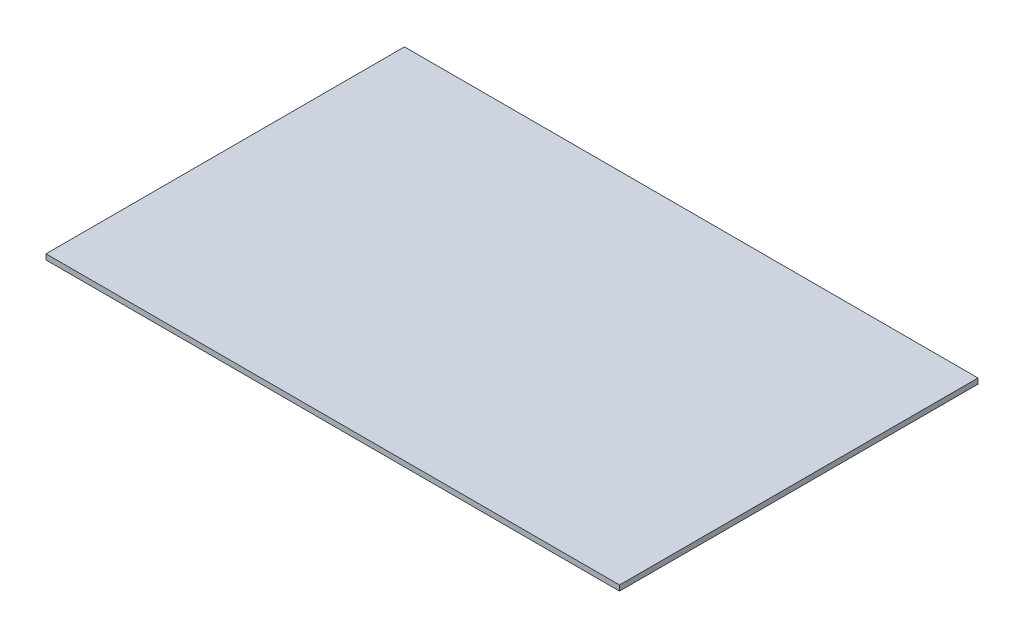
ISO-10303-21;
HEADER;
FILE_DESCRIPTION(('STEP AP214'),'2;1');
FILE_NAME('part.step','',(''),(''),'','','');
FILE_SCHEMA(('AUTOMOTIVE_DESIGN { 1 0 10303 214 1 1 1 1 }'));
ENDSEC;
DATA;
#1=APPLICATION_CONTEXT('core data for automotive mechanical design processes');
#2=APPLICATION_PROTOCOL_DEFINITION('international standard','automotive_design',2000,#1);
#3=PRODUCT_CONTEXT('',#1,'mechanical');
#4=PRODUCT('Part','Part','',(#3));
#5=PRODUCT_RELATED_PRODUCT_CATEGORY('part','',(#4));
#6=PRODUCT_DEFINITION_FORMATION('','',#4);
#7=PRODUCT_DEFINITION_CONTEXT('part definition',#1,'design');
#8=PRODUCT_DEFINITION('design','',#6,#7);
#9=PRODUCT_DEFINITION_SHAPE('','',#8);
#10=(LENGTH_UNIT() NAMED_UNIT(*) SI_UNIT(.MILLI.,.METRE.));
#11=(NAMED_UNIT(*) PLANE_ANGLE_UNIT() SI_UNIT($,.RADIAN.));
#12=(NAMED_UNIT(*) SI_UNIT($,.STERADIAN.) SOLID_ANGLE_UNIT());
#13=UNCERTAINTY_MEASURE_WITH_UNIT(LENGTH_MEASURE(1.E-05),#10,'distance_accuracy_value','');
#14=(GEOMETRIC_REPRESENTATION_CONTEXT(3) GLOBAL_UNCERTAINTY_ASSIGNED_CONTEXT((#13)) GLOBAL_UNIT_ASSIGNED_CONTEXT((#10,
#11,#12)) REPRESENTATION_CONTEXT('',''));
#15=CARTESIAN_POINT('',(0.,0.,0.));
#16=DIRECTION('',(0.,0.,1.));
#17=DIRECTION('',(1.,0.,0.));
#18=AXIS2_PLACEMENT_3D('',#15,#16,#17);
#19=CARTESIAN_POINT('',(80.,1.5,-50.));
#20=DIRECTION('',(-1.,0.,0.));
#21=DIRECTION('',(0.,0.,1.));
#22=AXIS2_PLACEMENT_3D('',#19,#20,#21);
#23=PLANE('',#22);
#24=DIRECTION('',(0.,0.,-1.));
#25=VECTOR('',#24,1.);
#26=CARTESIAN_POINT('',(80.,0.,-50.));
#27=LINE('',#26,#25);
#28=CARTESIAN_POINT('',(80.,0.,50.));
#29=VERTEX_POINT('',#28);
#30=CARTESIAN_POINT('',(80.,0.,-50.));
#31=VERTEX_POINT('',#30);
#32=EDGE_CURVE('E98',#29,#31,#27,.T.);
#33=ORIENTED_EDGE('',*,*,#32,.T.);
#34=DIRECTION('',(0.,-1.,0.));
#35=VECTOR('',#34,1.);
#36=CARTESIAN_POINT('',(80.,1.5,-50.));
#37=LINE('',#36,#35);
#38=CARTESIAN_POINT('',(80.,1.5,-50.));
#39=VERTEX_POINT('',#38);
#40=EDGE_CURVE('E11',#39,#31,#37,.T.);
#41=ORIENTED_EDGE('',*,*,#40,.F.);
#42=DIRECTION('',(0.,0.,-1.));
#43=VECTOR('',#42,1.);
#44=CARTESIAN_POINT('',(80.,1.5,-50.));
#45=LINE('',#44,#43);
#46=CARTESIAN_POINT('',(80.,1.5,50.));
#47=VERTEX_POINT('',#46);
#48=EDGE_CURVE('E86',#47,#39,#45,.T.);
#49=ORIENTED_EDGE('',*,*,#48,.F.);
#50=DIRECTION('',(0.,-1.,0.));
#51=VECTOR('',#50,1.);
#52=CARTESIAN_POINT('',(80.,1.5,50.));
#53=LINE('',#52,#51);
#54=EDGE_CURVE('E94',#47,#29,#53,.T.);
#55=ORIENTED_EDGE('',*,*,#54,.T.);
#56=EDGE_LOOP('',(#33,#41,#49,#55));
#57=FACE_BOUND('',#56,.T.);
#58=ADVANCED_FACE('F35',(#57),#23,.F.);
#59=CARTESIAN_POINT('',(-80.,1.5,-50.));
#60=DIRECTION('',(0.,0.,1.));
#61=DIRECTION('',(1.,0.,0.));
#62=AXIS2_PLACEMENT_3D('',#59,#60,#61);
#63=PLANE('',#62);
#64=DIRECTION('',(-1.,0.,0.));
#65=VECTOR('',#64,1.);
#66=CARTESIAN_POINT('',(-80.,0.,-50.));
#67=LINE('',#66,#65);
#68=CARTESIAN_POINT('',(-80.,0.,-50.));
#69=VERTEX_POINT('',#68);
#70=EDGE_CURVE('E90',#31,#69,#67,.T.);
#71=ORIENTED_EDGE('',*,*,#70,.T.);
#72=DIRECTION('',(0.,-1.,0.));
#73=VECTOR('',#72,1.);
#74=CARTESIAN_POINT('',(-80.,1.5,-50.));
#75=LINE('',#74,#73);
#76=CARTESIAN_POINT('',(-80.,1.5,-50.));
#77=VERTEX_POINT('',#76);
#78=EDGE_CURVE('E43',#77,#69,#75,.T.);
#79=ORIENTED_EDGE('',*,*,#78,.F.);
#80=DIRECTION('',(-1.,0.,0.));
#81=VECTOR('',#80,1.);
#82=CARTESIAN_POINT('',(-80.,1.5,-50.));
#83=LINE('',#82,#81);
#84=EDGE_CURVE('E81',#39,#77,#83,.T.);
#85=ORIENTED_EDGE('',*,*,#84,.F.);
#86=ORIENTED_EDGE('',*,*,#40,.T.);
#87=EDGE_LOOP('',(#71,#79,#85,#86));
#88=FACE_BOUND('',#87,.T.);
#89=ADVANCED_FACE('F89',(#88),#63,.F.);
#90=CARTESIAN_POINT('',(-80.,1.5,-50.));
#91=DIRECTION('',(1.,0.,0.));
#92=DIRECTION('',(0.,0.,-1.));
#93=AXIS2_PLACEMENT_3D('',#90,#91,#92);
#94=PLANE('',#93);
#95=DIRECTION('',(0.,0.,1.));
#96=VECTOR('',#95,1.);
#97=CARTESIAN_POINT('',(-80.,0.,-50.));
#98=LINE('',#97,#96);
#99=CARTESIAN_POINT('',(-80.,0.,50.));
#100=VERTEX_POINT('',#99);
#101=EDGE_CURVE('E68',#69,#100,#98,.T.);
#102=ORIENTED_EDGE('',*,*,#101,.T.);
#103=DIRECTION('',(0.,-1.,0.));
#104=VECTOR('',#103,1.);
#105=CARTESIAN_POINT('',(-80.,1.5,50.));
#106=LINE('',#105,#104);
#107=CARTESIAN_POINT('',(-80.,1.5,50.));
#108=VERTEX_POINT('',#107);
#109=EDGE_CURVE('E91',#108,#100,#106,.T.);
#110=ORIENTED_EDGE('',*,*,#109,.F.);
#111=DIRECTION('',(0.,0.,1.));
#112=VECTOR('',#111,1.);
#113=CARTESIAN_POINT('',(-80.,1.5,-50.));
#114=LINE('',#113,#112);
#115=EDGE_CURVE('E84',#77,#108,#114,.T.);
#116=ORIENTED_EDGE('',*,*,#115,.F.);
#117=ORIENTED_EDGE('',*,*,#78,.T.);
#118=EDGE_LOOP('',(#102,#110,#116,#117));
#119=FACE_BOUND('',#118,.T.);
#120=ADVANCED_FACE('F92',(#119),#94,.F.);
#121=CARTESIAN_POINT('',(-80.,1.5,50.));
#122=DIRECTION('',(0.,0.,-1.));
#123=DIRECTION('',(-1.,0.,0.));
#124=AXIS2_PLACEMENT_3D('',#121,#122,#123);
#125=PLANE('',#124);
#126=DIRECTION('',(1.,0.,0.));
#127=VECTOR('',#126,1.);
#128=CARTESIAN_POINT('',(-80.,0.,50.));
#129=LINE('',#128,#127);
#130=EDGE_CURVE('E74',#100,#29,#129,.T.);
#131=ORIENTED_EDGE('',*,*,#130,.T.);
#132=ORIENTED_EDGE('',*,*,#54,.F.);
#133=DIRECTION('',(1.,0.,0.));
#134=VECTOR('',#133,1.);
#135=CARTESIAN_POINT('',(-80.,1.5,50.));
#136=LINE('',#135,#134);
#137=EDGE_CURVE('E51',#108,#47,#136,.T.);
#138=ORIENTED_EDGE('',*,*,#137,.F.);
#139=ORIENTED_EDGE('',*,*,#109,.T.);
#140=EDGE_LOOP('',(#131,#132,#138,#139));
#141=FACE_BOUND('',#140,.T.);
#142=ADVANCED_FACE('F105',(#141),#125,.F.);
#143=CARTESIAN_POINT('',(0.,1.5,0.));
#144=DIRECTION('',(0.,1.,0.));
#145=DIRECTION('',(0.,0.,1.));
#146=AXIS2_PLACEMENT_3D('',#143,#144,#145);
#147=PLANE('',#146);
#148=ORIENTED_EDGE('',*,*,#48,.T.);
#149=ORIENTED_EDGE('',*,*,#84,.T.);
#150=ORIENTED_EDGE('',*,*,#115,.T.);
#151=ORIENTED_EDGE('',*,*,#137,.T.);
#152=EDGE_LOOP('',(#148,#149,#150,#151));
#153=FACE_BOUND('',#152,.T.);
#154=ADVANCED_FACE('F82',(#153),#147,.T.);
#155=CARTESIAN_POINT('',(0.,0.,0.));
#156=DIRECTION('',(0.,1.,0.));
#157=DIRECTION('',(0.,0.,1.));
#158=AXIS2_PLACEMENT_3D('',#155,#156,#157);
#159=PLANE('',#158);
#160=ORIENTED_EDGE('',*,*,#32,.F.);
#161=ORIENTED_EDGE('',*,*,#130,.F.);
#162=ORIENTED_EDGE('',*,*,#101,.F.);
#163=ORIENTED_EDGE('',*,*,#70,.F.);
#164=EDGE_LOOP('',(#160,#161,#162,#163));
#165=FACE_BOUND('',#164,.T.);
#166=ADVANCED_FACE('F108',(#165),#159,.F.);
#167=CLOSED_SHELL('',(#58,#89,#120,#142,#154,#166));
#168=MANIFOLD_SOLID_BREP('B2',#167);
#169=ADVANCED_BREP_SHAPE_REPRESENTATION('',(#18,#168),#14);
#170=SHAPE_DEFINITION_REPRESENTATION(#9,#169);
ENDSEC;
END-ISO-10303-21;
